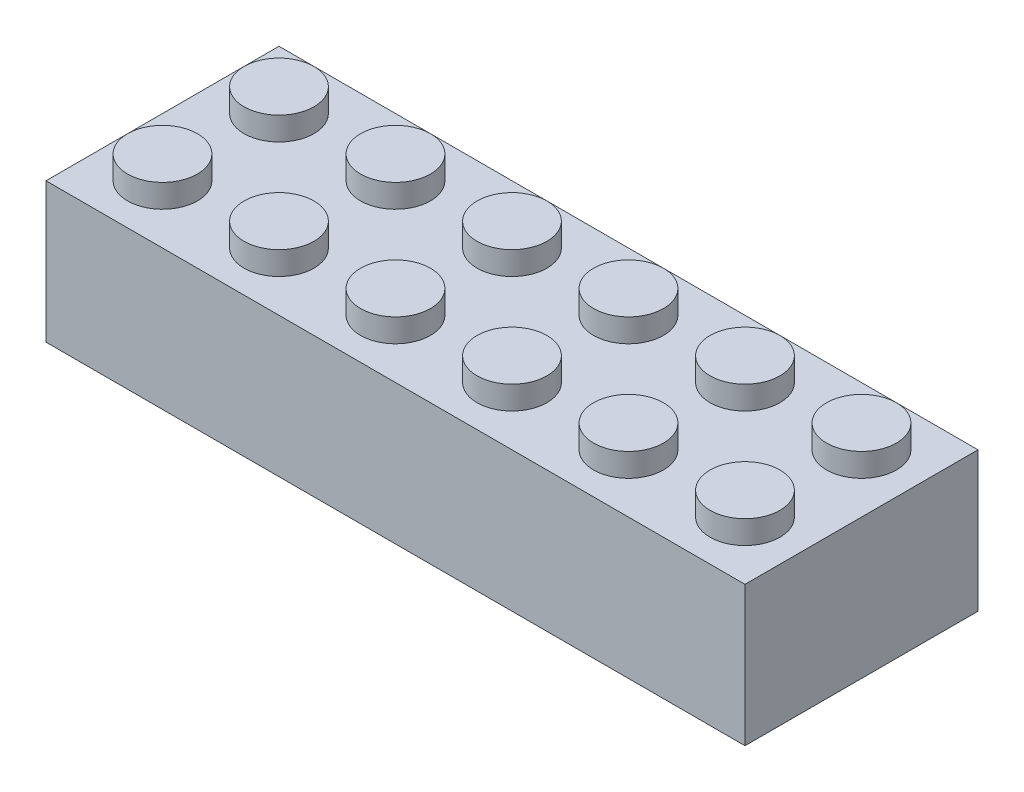
ISO-10303-21;
HEADER;
FILE_DESCRIPTION(('STEP AP214'),'2;1');
FILE_NAME('part.step','',(''),(''),'','','');
FILE_SCHEMA(('AUTOMOTIVE_DESIGN { 1 0 10303 214 1 1 1 1 }'));
ENDSEC;
DATA;
#1=APPLICATION_CONTEXT('core data for automotive mechanical design processes');
#2=APPLICATION_PROTOCOL_DEFINITION('international standard','automotive_design',2000,#1);
#3=PRODUCT_CONTEXT('',#1,'mechanical');
#4=PRODUCT('Part','Part','',(#3));
#5=PRODUCT_RELATED_PRODUCT_CATEGORY('part','',(#4));
#6=PRODUCT_DEFINITION_FORMATION('','',#4);
#7=PRODUCT_DEFINITION_CONTEXT('part definition',#1,'design');
#8=PRODUCT_DEFINITION('design','',#6,#7);
#9=PRODUCT_DEFINITION_SHAPE('','',#8);
#10=(LENGTH_UNIT() NAMED_UNIT(*) SI_UNIT(.MILLI.,.METRE.));
#11=(NAMED_UNIT(*) PLANE_ANGLE_UNIT() SI_UNIT($,.RADIAN.));
#12=(NAMED_UNIT(*) SI_UNIT($,.STERADIAN.) SOLID_ANGLE_UNIT());
#13=UNCERTAINTY_MEASURE_WITH_UNIT(LENGTH_MEASURE(1.E-05),#10,'distance_accuracy_value','');
#14=(GEOMETRIC_REPRESENTATION_CONTEXT(3) GLOBAL_UNCERTAINTY_ASSIGNED_CONTEXT((#13)) GLOBAL_UNIT_ASSIGNED_CONTEXT((#10,
#11,#12)) REPRESENTATION_CONTEXT('',''));
#15=CARTESIAN_POINT('',(0.,0.,0.));
#16=DIRECTION('',(0.,0.,1.));
#17=DIRECTION('',(1.,0.,0.));
#18=AXIS2_PLACEMENT_3D('',#15,#16,#17);
#19=CARTESIAN_POINT('',(-2.5,2.,-2.5));
#20=DIRECTION('',(0.,-1.,0.));
#21=DIRECTION('',(0.,0.,-1.));
#22=AXIS2_PLACEMENT_3D('',#19,#20,#21);
#23=CYLINDRICAL_SURFACE('',#22,1.5);
#24=CARTESIAN_POINT('',(-2.5,1.,-2.5));
#25=DIRECTION('',(0.,1.,0.));
#26=DIRECTION('',(0.,0.,1.));
#27=AXIS2_PLACEMENT_3D('',#24,#25,#26);
#28=CIRCLE('',#27,1.5);
#29=CARTESIAN_POINT('',(-2.5,1.,-1.));
#30=VERTEX_POINT('',#29);
#31=EDGE_CURVE('E185',#30,#30,#28,.T.);
#32=ORIENTED_EDGE('',*,*,#31,.T.);
#33=EDGE_LOOP('',(#32));
#34=FACE_BOUND('',#33,.T.);
#35=CARTESIAN_POINT('',(-2.5,2.,-2.5));
#36=DIRECTION('',(0.,1.,0.));
#37=DIRECTION('',(0.,0.,1.));
#38=AXIS2_PLACEMENT_3D('',#35,#36,#37);
#39=CIRCLE('',#38,1.5);
#40=CARTESIAN_POINT('',(-2.5,2.,-1.));
#41=VERTEX_POINT('',#40);
#42=EDGE_CURVE('E315',#41,#41,#39,.T.);
#43=ORIENTED_EDGE('',*,*,#42,.F.);
#44=EDGE_LOOP('',(#43));
#45=FACE_BOUND('',#44,.T.);
#46=ADVANCED_FACE('F110',(#34,#45),#23,.T.);
#47=CARTESIAN_POINT('',(0.,2.,0.));
#48=DIRECTION('',(0.,1.,0.));
#49=DIRECTION('',(0.,0.,1.));
#50=AXIS2_PLACEMENT_3D('',#47,#48,#49);
#51=PLANE('',#50);
#52=ORIENTED_EDGE('',*,*,#42,.T.);
#53=EDGE_LOOP('',(#52));
#54=FACE_BOUND('',#53,.T.);
#55=ADVANCED_FACE('F359',(#54),#51,.T.);
#56=CARTESIAN_POINT('',(-15.,1.,5.));
#57=DIRECTION('',(0.,0.,-1.));
#58=DIRECTION('',(-1.,0.,0.));
#59=AXIS2_PLACEMENT_3D('',#56,#57,#58);
#60=PLANE('',#59);
#61=DIRECTION('',(0.,-1.,0.));
#62=VECTOR('',#61,1.);
#63=CARTESIAN_POINT('',(-15.,1.,5.));
#64=LINE('',#63,#62);
#65=CARTESIAN_POINT('',(-15.,1.,5.));
#66=VERTEX_POINT('',#65);
#67=CARTESIAN_POINT('',(-15.,-5.,5.));
#68=VERTEX_POINT('',#67);
#69=EDGE_CURVE('E132',#66,#68,#64,.T.);
#70=ORIENTED_EDGE('',*,*,#69,.T.);
#71=DIRECTION('',(1.,0.,0.));
#72=VECTOR('',#71,1.);
#73=CARTESIAN_POINT('',(0.,-5.,5.));
#74=LINE('',#73,#72);
#75=CARTESIAN_POINT('',(15.,-5.,5.));
#76=VERTEX_POINT('',#75);
#77=EDGE_CURVE('E194',#68,#76,#74,.T.);
#78=ORIENTED_EDGE('',*,*,#77,.T.);
#79=DIRECTION('',(0.,-1.,0.));
#80=VECTOR('',#79,1.);
#81=CARTESIAN_POINT('',(15.,1.,5.));
#82=LINE('',#81,#80);
#83=CARTESIAN_POINT('',(15.,1.,5.));
#84=VERTEX_POINT('',#83);
#85=EDGE_CURVE('E176',#84,#76,#82,.T.);
#86=ORIENTED_EDGE('',*,*,#85,.F.);
#87=DIRECTION('',(1.,0.,0.));
#88=VECTOR('',#87,1.);
#89=CARTESIAN_POINT('',(-15.,1.,5.));
#90=LINE('',#89,#88);
#91=EDGE_CURVE('E303',#66,#84,#90,.T.);
#92=ORIENTED_EDGE('',*,*,#91,.F.);
#93=EDGE_LOOP('',(#70,#78,#86,#92));
#94=FACE_BOUND('',#93,.T.);
#95=ADVANCED_FACE('F198',(#94),#60,.F.);
#96=CARTESIAN_POINT('',(15.,1.,5.));
#97=DIRECTION('',(-1.,0.,0.));
#98=DIRECTION('',(0.,0.,1.));
#99=AXIS2_PLACEMENT_3D('',#96,#97,#98);
#100=PLANE('',#99);
#101=ORIENTED_EDGE('',*,*,#85,.T.);
#102=DIRECTION('',(0.,0.,-1.));
#103=VECTOR('',#102,1.);
#104=CARTESIAN_POINT('',(15.,-5.,0.));
#105=LINE('',#104,#103);
#106=CARTESIAN_POINT('',(15.,-5.,-5.));
#107=VERTEX_POINT('',#106);
#108=EDGE_CURVE('E180',#76,#107,#105,.T.);
#109=ORIENTED_EDGE('',*,*,#108,.T.);
#110=DIRECTION('',(0.,-1.,0.));
#111=VECTOR('',#110,1.);
#112=CARTESIAN_POINT('',(15.,1.,-5.));
#113=LINE('',#112,#111);
#114=CARTESIAN_POINT('',(15.,1.,-5.));
#115=VERTEX_POINT('',#114);
#116=EDGE_CURVE('E186',#115,#107,#113,.T.);
#117=ORIENTED_EDGE('',*,*,#116,.F.);
#118=DIRECTION('',(0.,0.,-1.));
#119=VECTOR('',#118,1.);
#120=CARTESIAN_POINT('',(15.,1.,5.));
#121=LINE('',#120,#119);
#122=EDGE_CURVE('E181',#84,#115,#121,.T.);
#123=ORIENTED_EDGE('',*,*,#122,.F.);
#124=EDGE_LOOP('',(#101,#109,#117,#123));
#125=FACE_BOUND('',#124,.T.);
#126=ADVANCED_FACE('F178',(#125),#100,.F.);
#127=CARTESIAN_POINT('',(-15.,1.,-5.));
#128=DIRECTION('',(0.,0.,-1.));
#129=DIRECTION('',(-1.,0.,0.));
#130=AXIS2_PLACEMENT_3D('',#127,#128,#129);
#131=PLANE('',#130);
#132=ORIENTED_EDGE('',*,*,#116,.T.);
#133=DIRECTION('',(1.,0.,0.));
#134=VECTOR('',#133,1.);
#135=CARTESIAN_POINT('',(0.,-5.,-5.));
#136=LINE('',#135,#134);
#137=CARTESIAN_POINT('',(-15.,-5.,-5.));
#138=VERTEX_POINT('',#137);
#139=EDGE_CURVE('E196',#138,#107,#136,.T.);
#140=ORIENTED_EDGE('',*,*,#139,.F.);
#141=DIRECTION('',(0.,-1.,0.));
#142=VECTOR('',#141,1.);
#143=CARTESIAN_POINT('',(-15.,1.,-5.));
#144=LINE('',#143,#142);
#145=CARTESIAN_POINT('',(-15.,1.,-5.));
#146=VERTEX_POINT('',#145);
#147=EDGE_CURVE('E312',#146,#138,#144,.T.);
#148=ORIENTED_EDGE('',*,*,#147,.F.);
#149=DIRECTION('',(1.,0.,0.));
#150=VECTOR('',#149,1.);
#151=CARTESIAN_POINT('',(-15.,1.,-5.));
#152=LINE('',#151,#150);
#153=EDGE_CURVE('E306',#146,#115,#152,.T.);
#154=ORIENTED_EDGE('',*,*,#153,.T.);
#155=EDGE_LOOP('',(#132,#140,#148,#154));
#156=FACE_BOUND('',#155,.T.);
#157=ADVANCED_FACE('F379',(#156),#131,.T.);
#158=CARTESIAN_POINT('',(-15.,1.,5.));
#159=DIRECTION('',(-1.,0.,0.));
#160=DIRECTION('',(0.,0.,1.));
#161=AXIS2_PLACEMENT_3D('',#158,#159,#160);
#162=PLANE('',#161);
#163=ORIENTED_EDGE('',*,*,#147,.T.);
#164=DIRECTION('',(0.,0.,-1.));
#165=VECTOR('',#164,1.);
#166=CARTESIAN_POINT('',(-15.,-5.,0.));
#167=LINE('',#166,#165);
#168=EDGE_CURVE('E208',#68,#138,#167,.T.);
#169=ORIENTED_EDGE('',*,*,#168,.F.);
#170=ORIENTED_EDGE('',*,*,#69,.F.);
#171=DIRECTION('',(0.,0.,-1.));
#172=VECTOR('',#171,1.);
#173=CARTESIAN_POINT('',(-15.,1.,5.));
#174=LINE('',#173,#172);
#175=EDGE_CURVE('E309',#66,#146,#174,.T.);
#176=ORIENTED_EDGE('',*,*,#175,.T.);
#177=EDGE_LOOP('',(#163,#169,#170,#176));
#178=FACE_BOUND('',#177,.T.);
#179=ADVANCED_FACE('F373',(#178),#162,.T.);
#180=CARTESIAN_POINT('',(0.,1.,0.));
#181=DIRECTION('',(0.,1.,0.));
#182=DIRECTION('',(0.,0.,1.));
#183=AXIS2_PLACEMENT_3D('',#180,#181,#182);
#184=PLANE('',#183);
#185=CARTESIAN_POINT('',(2.50000000000005,1.,2.5));
#186=DIRECTION('',(0.,1.,0.));
#187=DIRECTION('',(0.,0.,1.));
#188=AXIS2_PLACEMENT_3D('',#185,#186,#187);
#189=CIRCLE('',#188,1.5);
#190=CARTESIAN_POINT('',(2.50000000000005,1.,4.));
#191=VERTEX_POINT('',#190);
#192=EDGE_CURVE('E240',#191,#191,#189,.F.);
#193=ORIENTED_EDGE('',*,*,#192,.T.);
#194=EDGE_LOOP('',(#193));
#195=FACE_BOUND('',#194,.T.);
#196=CARTESIAN_POINT('',(7.50000000000005,1.,2.5));
#197=DIRECTION('',(0.,1.,0.));
#198=DIRECTION('',(0.,0.,1.));
#199=AXIS2_PLACEMENT_3D('',#196,#197,#198);
#200=CIRCLE('',#199,1.5);
#201=CARTESIAN_POINT('',(7.50000000000005,1.,4.));
#202=VERTEX_POINT('',#201);
#203=EDGE_CURVE('E246',#202,#202,#200,.F.);
#204=ORIENTED_EDGE('',*,*,#203,.T.);
#205=EDGE_LOOP('',(#204));
#206=FACE_BOUND('',#205,.T.);
#207=CARTESIAN_POINT('',(12.5000000000001,1.,2.5));
#208=DIRECTION('',(0.,1.,0.));
#209=DIRECTION('',(0.,0.,1.));
#210=AXIS2_PLACEMENT_3D('',#207,#208,#209);
#211=CIRCLE('',#210,1.5);
#212=CARTESIAN_POINT('',(12.5000000000001,1.,4.));
#213=VERTEX_POINT('',#212);
#214=EDGE_CURVE('E252',#213,#213,#211,.F.);
#215=ORIENTED_EDGE('',*,*,#214,.T.);
#216=EDGE_LOOP('',(#215));
#217=FACE_BOUND('',#216,.T.);
#218=CARTESIAN_POINT('',(12.5,1.,-2.5));
#219=DIRECTION('',(0.,1.,0.));
#220=DIRECTION('',(0.,0.,1.));
#221=AXIS2_PLACEMENT_3D('',#218,#219,#220);
#222=CIRCLE('',#221,1.5);
#223=CARTESIAN_POINT('',(12.5,1.,-1.));
#224=VERTEX_POINT('',#223);
#225=EDGE_CURVE('E258',#224,#224,#222,.F.);
#226=ORIENTED_EDGE('',*,*,#225,.T.);
#227=EDGE_LOOP('',(#226));
#228=FACE_BOUND('',#227,.T.);
#229=CARTESIAN_POINT('',(7.5,1.,-2.5));
#230=DIRECTION('',(0.,1.,0.));
#231=DIRECTION('',(0.,0.,1.));
#232=AXIS2_PLACEMENT_3D('',#229,#230,#231);
#233=CIRCLE('',#232,1.5);
#234=CARTESIAN_POINT('',(7.5,1.,-1.));
#235=VERTEX_POINT('',#234);
#236=EDGE_CURVE('E264',#235,#235,#233,.F.);
#237=ORIENTED_EDGE('',*,*,#236,.T.);
#238=EDGE_LOOP('',(#237));
#239=FACE_BOUND('',#238,.T.);
#240=CARTESIAN_POINT('',(2.5,1.,-2.5));
#241=DIRECTION('',(0.,1.,0.));
#242=DIRECTION('',(0.,0.,1.));
#243=AXIS2_PLACEMENT_3D('',#240,#241,#242);
#244=CIRCLE('',#243,1.5);
#245=CARTESIAN_POINT('',(2.5,1.,-1.));
#246=VERTEX_POINT('',#245);
#247=EDGE_CURVE('E270',#246,#246,#244,.F.);
#248=ORIENTED_EDGE('',*,*,#247,.T.);
#249=EDGE_LOOP('',(#248));
#250=FACE_BOUND('',#249,.T.);
#251=CARTESIAN_POINT('',(-2.49999999999995,1.,2.5));
#252=DIRECTION('',(0.,1.,0.));
#253=DIRECTION('',(0.,0.,1.));
#254=AXIS2_PLACEMENT_3D('',#251,#252,#253);
#255=CIRCLE('',#254,1.5);
#256=CARTESIAN_POINT('',(-2.49999999999995,1.,4.));
#257=VERTEX_POINT('',#256);
#258=EDGE_CURVE('E276',#257,#257,#255,.F.);
#259=ORIENTED_EDGE('',*,*,#258,.T.);
#260=EDGE_LOOP('',(#259));
#261=FACE_BOUND('',#260,.T.);
#262=CARTESIAN_POINT('',(-7.49999999999995,1.,2.5));
#263=DIRECTION('',(0.,1.,0.));
#264=DIRECTION('',(0.,0.,1.));
#265=AXIS2_PLACEMENT_3D('',#262,#263,#264);
#266=CIRCLE('',#265,1.5);
#267=CARTESIAN_POINT('',(-7.49999999999995,1.,4.));
#268=VERTEX_POINT('',#267);
#269=EDGE_CURVE('E282',#268,#268,#266,.F.);
#270=ORIENTED_EDGE('',*,*,#269,.T.);
#271=EDGE_LOOP('',(#270));
#272=FACE_BOUND('',#271,.T.);
#273=CARTESIAN_POINT('',(-12.4999999999999,1.,2.5));
#274=DIRECTION('',(0.,1.,0.));
#275=DIRECTION('',(0.,0.,1.));
#276=AXIS2_PLACEMENT_3D('',#273,#274,#275);
#277=CIRCLE('',#276,1.5);
#278=CARTESIAN_POINT('',(-12.4999999999999,1.,4.));
#279=VERTEX_POINT('',#278);
#280=EDGE_CURVE('E288',#279,#279,#277,.F.);
#281=ORIENTED_EDGE('',*,*,#280,.T.);
#282=EDGE_LOOP('',(#281));
#283=FACE_BOUND('',#282,.T.);
#284=CARTESIAN_POINT('',(-12.5,1.,-2.5));
#285=DIRECTION('',(0.,1.,0.));
#286=DIRECTION('',(0.,0.,1.));
#287=AXIS2_PLACEMENT_3D('',#284,#285,#286);
#288=CIRCLE('',#287,1.5);
#289=CARTESIAN_POINT('',(-12.5,1.,-1.));
#290=VERTEX_POINT('',#289);
#291=EDGE_CURVE('E294',#290,#290,#288,.F.);
#292=ORIENTED_EDGE('',*,*,#291,.T.);
#293=EDGE_LOOP('',(#292));
#294=FACE_BOUND('',#293,.T.);
#295=CARTESIAN_POINT('',(-7.5,1.,-2.5));
#296=DIRECTION('',(0.,1.,0.));
#297=DIRECTION('',(0.,0.,1.));
#298=AXIS2_PLACEMENT_3D('',#295,#296,#297);
#299=CIRCLE('',#298,1.5);
#300=CARTESIAN_POINT('',(-7.5,1.,-1.));
#301=VERTEX_POINT('',#300);
#302=EDGE_CURVE('E300',#301,#301,#299,.F.);
#303=ORIENTED_EDGE('',*,*,#302,.T.);
#304=EDGE_LOOP('',(#303));
#305=FACE_BOUND('',#304,.T.);
#306=ORIENTED_EDGE('',*,*,#31,.F.);
#307=EDGE_LOOP('',(#306));
#308=FACE_BOUND('',#307,.T.);
#309=ORIENTED_EDGE('',*,*,#91,.T.);
#310=ORIENTED_EDGE('',*,*,#122,.T.);
#311=ORIENTED_EDGE('',*,*,#153,.F.);
#312=ORIENTED_EDGE('',*,*,#175,.F.);
#313=EDGE_LOOP('',(#309,#310,#311,#312));
#314=FACE_BOUND('',#313,.T.);
#315=ADVANCED_FACE('F369',(#195,#206,#217,#228,#239,#250,#261,#272,#283,#294,#305,#308,#314),
#184,.T.);
#316=CARTESIAN_POINT('',(-7.5,2.,-2.5));
#317=DIRECTION('',(0.,-1.,0.));
#318=DIRECTION('',(0.,0.,-1.));
#319=AXIS2_PLACEMENT_3D('',#316,#317,#318);
#320=CYLINDRICAL_SURFACE('',#319,1.5);
#321=ORIENTED_EDGE('',*,*,#302,.F.);
#322=EDGE_LOOP('',(#321));
#323=FACE_BOUND('',#322,.T.);
#324=CARTESIAN_POINT('',(-7.5,2.,-2.5));
#325=DIRECTION('',(0.,1.,0.));
#326=DIRECTION('',(0.,0.,1.));
#327=AXIS2_PLACEMENT_3D('',#324,#325,#326);
#328=CIRCLE('',#327,1.5);
#329=CARTESIAN_POINT('',(-7.5,2.,-1.));
#330=VERTEX_POINT('',#329);
#331=EDGE_CURVE('E297',#330,#330,#328,.T.);
#332=ORIENTED_EDGE('',*,*,#331,.F.);
#333=EDGE_LOOP('',(#332));
#334=FACE_BOUND('',#333,.T.);
#335=ADVANCED_FACE('F372',(#323,#334),#320,.T.);
#336=CARTESIAN_POINT('',(0.,2.,0.));
#337=DIRECTION('',(0.,1.,0.));
#338=DIRECTION('',(0.,0.,1.));
#339=AXIS2_PLACEMENT_3D('',#336,#337,#338);
#340=PLANE('',#339);
#341=ORIENTED_EDGE('',*,*,#331,.T.);
#342=EDGE_LOOP('',(#341));
#343=FACE_BOUND('',#342,.T.);
#344=ADVANCED_FACE('F679',(#343),#340,.T.);
#345=CARTESIAN_POINT('',(-12.5,2.,-2.5));
#346=DIRECTION('',(0.,-1.,0.));
#347=DIRECTION('',(0.,0.,-1.));
#348=AXIS2_PLACEMENT_3D('',#345,#346,#347);
#349=CYLINDRICAL_SURFACE('',#348,1.5);
#350=ORIENTED_EDGE('',*,*,#291,.F.);
#351=EDGE_LOOP('',(#350));
#352=FACE_BOUND('',#351,.T.);
#353=CARTESIAN_POINT('',(-12.5,2.,-2.5));
#354=DIRECTION('',(0.,1.,0.));
#355=DIRECTION('',(0.,0.,1.));
#356=AXIS2_PLACEMENT_3D('',#353,#354,#355);
#357=CIRCLE('',#356,1.5);
#358=CARTESIAN_POINT('',(-12.5,2.,-1.));
#359=VERTEX_POINT('',#358);
#360=EDGE_CURVE('E291',#359,#359,#357,.T.);
#361=ORIENTED_EDGE('',*,*,#360,.F.);
#362=EDGE_LOOP('',(#361));
#363=FACE_BOUND('',#362,.T.);
#364=ADVANCED_FACE('F689',(#352,#363),#349,.T.);
#365=CARTESIAN_POINT('',(0.,2.,0.));
#366=DIRECTION('',(0.,1.,0.));
#367=DIRECTION('',(0.,0.,1.));
#368=AXIS2_PLACEMENT_3D('',#365,#366,#367);
#369=PLANE('',#368);
#370=ORIENTED_EDGE('',*,*,#360,.T.);
#371=EDGE_LOOP('',(#370));
#372=FACE_BOUND('',#371,.T.);
#373=ADVANCED_FACE('F699',(#372),#369,.T.);
#374=CARTESIAN_POINT('',(-12.4999999999999,2.,2.5));
#375=DIRECTION('',(0.,-1.,0.));
#376=DIRECTION('',(0.,0.,-1.));
#377=AXIS2_PLACEMENT_3D('',#374,#375,#376);
#378=CYLINDRICAL_SURFACE('',#377,1.5);
#379=ORIENTED_EDGE('',*,*,#280,.F.);
#380=EDGE_LOOP('',(#379));
#381=FACE_BOUND('',#380,.T.);
#382=CARTESIAN_POINT('',(-12.4999999999999,2.,2.5));
#383=DIRECTION('',(0.,1.,0.));
#384=DIRECTION('',(0.,0.,1.));
#385=AXIS2_PLACEMENT_3D('',#382,#383,#384);
#386=CIRCLE('',#385,1.5);
#387=CARTESIAN_POINT('',(-12.4999999999999,2.,4.));
#388=VERTEX_POINT('',#387);
#389=EDGE_CURVE('E285',#388,#388,#386,.T.);
#390=ORIENTED_EDGE('',*,*,#389,.F.);
#391=EDGE_LOOP('',(#390));
#392=FACE_BOUND('',#391,.T.);
#393=ADVANCED_FACE('F709',(#381,#392),#378,.T.);
#394=CARTESIAN_POINT('',(0.,2.,0.));
#395=DIRECTION('',(0.,1.,0.));
#396=DIRECTION('',(0.,0.,1.));
#397=AXIS2_PLACEMENT_3D('',#394,#395,#396);
#398=PLANE('',#397);
#399=ORIENTED_EDGE('',*,*,#389,.T.);
#400=EDGE_LOOP('',(#399));
#401=FACE_BOUND('',#400,.T.);
#402=ADVANCED_FACE('F719',(#401),#398,.T.);
#403=CARTESIAN_POINT('',(-7.49999999999995,2.,2.5));
#404=DIRECTION('',(0.,-1.,0.));
#405=DIRECTION('',(0.,0.,-1.));
#406=AXIS2_PLACEMENT_3D('',#403,#404,#405);
#407=CYLINDRICAL_SURFACE('',#406,1.5);
#408=ORIENTED_EDGE('',*,*,#269,.F.);
#409=EDGE_LOOP('',(#408));
#410=FACE_BOUND('',#409,.T.);
#411=CARTESIAN_POINT('',(-7.49999999999995,2.,2.5));
#412=DIRECTION('',(0.,1.,0.));
#413=DIRECTION('',(0.,0.,1.));
#414=AXIS2_PLACEMENT_3D('',#411,#412,#413);
#415=CIRCLE('',#414,1.5);
#416=CARTESIAN_POINT('',(-7.49999999999995,2.,4.));
#417=VERTEX_POINT('',#416);
#418=EDGE_CURVE('E279',#417,#417,#415,.T.);
#419=ORIENTED_EDGE('',*,*,#418,.F.);
#420=EDGE_LOOP('',(#419));
#421=FACE_BOUND('',#420,.T.);
#422=ADVANCED_FACE('F729',(#410,#421),#407,.T.);
#423=CARTESIAN_POINT('',(0.,2.,0.));
#424=DIRECTION('',(0.,1.,0.));
#425=DIRECTION('',(0.,0.,1.));
#426=AXIS2_PLACEMENT_3D('',#423,#424,#425);
#427=PLANE('',#426);
#428=ORIENTED_EDGE('',*,*,#418,.T.);
#429=EDGE_LOOP('',(#428));
#430=FACE_BOUND('',#429,.T.);
#431=ADVANCED_FACE('F739',(#430),#427,.T.);
#432=CARTESIAN_POINT('',(-2.49999999999995,2.,2.5));
#433=DIRECTION('',(0.,-1.,0.));
#434=DIRECTION('',(0.,0.,-1.));
#435=AXIS2_PLACEMENT_3D('',#432,#433,#434);
#436=CYLINDRICAL_SURFACE('',#435,1.5);
#437=ORIENTED_EDGE('',*,*,#258,.F.);
#438=EDGE_LOOP('',(#437));
#439=FACE_BOUND('',#438,.T.);
#440=CARTESIAN_POINT('',(-2.49999999999995,2.,2.5));
#441=DIRECTION('',(0.,1.,0.));
#442=DIRECTION('',(0.,0.,1.));
#443=AXIS2_PLACEMENT_3D('',#440,#441,#442);
#444=CIRCLE('',#443,1.5);
#445=CARTESIAN_POINT('',(-2.49999999999995,2.,4.));
#446=VERTEX_POINT('',#445);
#447=EDGE_CURVE('E273',#446,#446,#444,.T.);
#448=ORIENTED_EDGE('',*,*,#447,.F.);
#449=EDGE_LOOP('',(#448));
#450=FACE_BOUND('',#449,.T.);
#451=ADVANCED_FACE('F749',(#439,#450),#436,.T.);
#452=CARTESIAN_POINT('',(0.,2.,0.));
#453=DIRECTION('',(0.,1.,0.));
#454=DIRECTION('',(0.,0.,1.));
#455=AXIS2_PLACEMENT_3D('',#452,#453,#454);
#456=PLANE('',#455);
#457=ORIENTED_EDGE('',*,*,#447,.T.);
#458=EDGE_LOOP('',(#457));
#459=FACE_BOUND('',#458,.T.);
#460=ADVANCED_FACE('F759',(#459),#456,.T.);
#461=CARTESIAN_POINT('',(2.5,2.,-2.5));
#462=DIRECTION('',(0.,-1.,0.));
#463=DIRECTION('',(0.,0.,-1.));
#464=AXIS2_PLACEMENT_3D('',#461,#462,#463);
#465=CYLINDRICAL_SURFACE('',#464,1.5);
#466=ORIENTED_EDGE('',*,*,#247,.F.);
#467=EDGE_LOOP('',(#466));
#468=FACE_BOUND('',#467,.T.);
#469=CARTESIAN_POINT('',(2.5,2.,-2.5));
#470=DIRECTION('',(0.,1.,0.));
#471=DIRECTION('',(0.,0.,1.));
#472=AXIS2_PLACEMENT_3D('',#469,#470,#471);
#473=CIRCLE('',#472,1.5);
#474=CARTESIAN_POINT('',(2.5,2.,-1.));
#475=VERTEX_POINT('',#474);
#476=EDGE_CURVE('E267',#475,#475,#473,.T.);
#477=ORIENTED_EDGE('',*,*,#476,.F.);
#478=EDGE_LOOP('',(#477));
#479=FACE_BOUND('',#478,.T.);
#480=ADVANCED_FACE('F769',(#468,#479),#465,.T.);
#481=CARTESIAN_POINT('',(0.,2.,0.));
#482=DIRECTION('',(0.,1.,0.));
#483=DIRECTION('',(0.,0.,1.));
#484=AXIS2_PLACEMENT_3D('',#481,#482,#483);
#485=PLANE('',#484);
#486=ORIENTED_EDGE('',*,*,#476,.T.);
#487=EDGE_LOOP('',(#486));
#488=FACE_BOUND('',#487,.T.);
#489=ADVANCED_FACE('F779',(#488),#485,.T.);
#490=CARTESIAN_POINT('',(7.5,2.,-2.5));
#491=DIRECTION('',(0.,-1.,0.));
#492=DIRECTION('',(0.,0.,-1.));
#493=AXIS2_PLACEMENT_3D('',#490,#491,#492);
#494=CYLINDRICAL_SURFACE('',#493,1.5);
#495=ORIENTED_EDGE('',*,*,#236,.F.);
#496=EDGE_LOOP('',(#495));
#497=FACE_BOUND('',#496,.T.);
#498=CARTESIAN_POINT('',(7.5,2.,-2.5));
#499=DIRECTION('',(0.,1.,0.));
#500=DIRECTION('',(0.,0.,1.));
#501=AXIS2_PLACEMENT_3D('',#498,#499,#500);
#502=CIRCLE('',#501,1.5);
#503=CARTESIAN_POINT('',(7.5,2.,-1.));
#504=VERTEX_POINT('',#503);
#505=EDGE_CURVE('E261',#504,#504,#502,.T.);
#506=ORIENTED_EDGE('',*,*,#505,.F.);
#507=EDGE_LOOP('',(#506));
#508=FACE_BOUND('',#507,.T.);
#509=ADVANCED_FACE('F789',(#497,#508),#494,.T.);
#510=CARTESIAN_POINT('',(0.,2.,0.));
#511=DIRECTION('',(0.,1.,0.));
#512=DIRECTION('',(0.,0.,1.));
#513=AXIS2_PLACEMENT_3D('',#510,#511,#512);
#514=PLANE('',#513);
#515=ORIENTED_EDGE('',*,*,#505,.T.);
#516=EDGE_LOOP('',(#515));
#517=FACE_BOUND('',#516,.T.);
#518=ADVANCED_FACE('F799',(#517),#514,.T.);
#519=CARTESIAN_POINT('',(12.5,2.,-2.5));
#520=DIRECTION('',(0.,-1.,0.));
#521=DIRECTION('',(0.,0.,-1.));
#522=AXIS2_PLACEMENT_3D('',#519,#520,#521);
#523=CYLINDRICAL_SURFACE('',#522,1.5);
#524=ORIENTED_EDGE('',*,*,#225,.F.);
#525=EDGE_LOOP('',(#524));
#526=FACE_BOUND('',#525,.T.);
#527=CARTESIAN_POINT('',(12.5,2.,-2.5));
#528=DIRECTION('',(0.,1.,0.));
#529=DIRECTION('',(0.,0.,1.));
#530=AXIS2_PLACEMENT_3D('',#527,#528,#529);
#531=CIRCLE('',#530,1.5);
#532=CARTESIAN_POINT('',(12.5,2.,-1.));
#533=VERTEX_POINT('',#532);
#534=EDGE_CURVE('E255',#533,#533,#531,.T.);
#535=ORIENTED_EDGE('',*,*,#534,.F.);
#536=EDGE_LOOP('',(#535));
#537=FACE_BOUND('',#536,.T.);
#538=ADVANCED_FACE('F809',(#526,#537),#523,.T.);
#539=CARTESIAN_POINT('',(0.,2.,0.));
#540=DIRECTION('',(0.,1.,0.));
#541=DIRECTION('',(0.,0.,1.));
#542=AXIS2_PLACEMENT_3D('',#539,#540,#541);
#543=PLANE('',#542);
#544=ORIENTED_EDGE('',*,*,#534,.T.);
#545=EDGE_LOOP('',(#544));
#546=FACE_BOUND('',#545,.T.);
#547=ADVANCED_FACE('F819',(#546),#543,.T.);
#548=CARTESIAN_POINT('',(12.5000000000001,2.,2.5));
#549=DIRECTION('',(0.,-1.,0.));
#550=DIRECTION('',(0.,0.,-1.));
#551=AXIS2_PLACEMENT_3D('',#548,#549,#550);
#552=CYLINDRICAL_SURFACE('',#551,1.5);
#553=ORIENTED_EDGE('',*,*,#214,.F.);
#554=EDGE_LOOP('',(#553));
#555=FACE_BOUND('',#554,.T.);
#556=CARTESIAN_POINT('',(12.5000000000001,2.,2.5));
#557=DIRECTION('',(0.,1.,0.));
#558=DIRECTION('',(0.,0.,1.));
#559=AXIS2_PLACEMENT_3D('',#556,#557,#558);
#560=CIRCLE('',#559,1.5);
#561=CARTESIAN_POINT('',(12.5000000000001,2.,4.));
#562=VERTEX_POINT('',#561);
#563=EDGE_CURVE('E249',#562,#562,#560,.T.);
#564=ORIENTED_EDGE('',*,*,#563,.F.);
#565=EDGE_LOOP('',(#564));
#566=FACE_BOUND('',#565,.T.);
#567=ADVANCED_FACE('F829',(#555,#566),#552,.T.);
#568=CARTESIAN_POINT('',(0.,2.,0.));
#569=DIRECTION('',(0.,1.,0.));
#570=DIRECTION('',(0.,0.,1.));
#571=AXIS2_PLACEMENT_3D('',#568,#569,#570);
#572=PLANE('',#571);
#573=ORIENTED_EDGE('',*,*,#563,.T.);
#574=EDGE_LOOP('',(#573));
#575=FACE_BOUND('',#574,.T.);
#576=ADVANCED_FACE('F839',(#575),#572,.T.);
#577=CARTESIAN_POINT('',(7.50000000000005,2.,2.5));
#578=DIRECTION('',(0.,-1.,0.));
#579=DIRECTION('',(0.,0.,-1.));
#580=AXIS2_PLACEMENT_3D('',#577,#578,#579);
#581=CYLINDRICAL_SURFACE('',#580,1.5);
#582=ORIENTED_EDGE('',*,*,#203,.F.);
#583=EDGE_LOOP('',(#582));
#584=FACE_BOUND('',#583,.T.);
#585=CARTESIAN_POINT('',(7.50000000000005,2.,2.5));
#586=DIRECTION('',(0.,1.,0.));
#587=DIRECTION('',(0.,0.,1.));
#588=AXIS2_PLACEMENT_3D('',#585,#586,#587);
#589=CIRCLE('',#588,1.5);
#590=CARTESIAN_POINT('',(7.50000000000005,2.,4.));
#591=VERTEX_POINT('',#590);
#592=EDGE_CURVE('E243',#591,#591,#589,.T.);
#593=ORIENTED_EDGE('',*,*,#592,.F.);
#594=EDGE_LOOP('',(#593));
#595=FACE_BOUND('',#594,.T.);
#596=ADVANCED_FACE('F849',(#584,#595),#581,.T.);
#597=CARTESIAN_POINT('',(0.,2.,0.));
#598=DIRECTION('',(0.,1.,0.));
#599=DIRECTION('',(0.,0.,1.));
#600=AXIS2_PLACEMENT_3D('',#597,#598,#599);
#601=PLANE('',#600);
#602=ORIENTED_EDGE('',*,*,#592,.T.);
#603=EDGE_LOOP('',(#602));
#604=FACE_BOUND('',#603,.T.);
#605=ADVANCED_FACE('F859',(#604),#601,.T.);
#606=CARTESIAN_POINT('',(2.50000000000005,2.,2.5));
#607=DIRECTION('',(0.,-1.,0.));
#608=DIRECTION('',(0.,0.,-1.));
#609=AXIS2_PLACEMENT_3D('',#606,#607,#608);
#610=CYLINDRICAL_SURFACE('',#609,1.5);
#611=ORIENTED_EDGE('',*,*,#192,.F.);
#612=EDGE_LOOP('',(#611));
#613=FACE_BOUND('',#612,.T.);
#614=CARTESIAN_POINT('',(2.50000000000005,2.,2.5));
#615=DIRECTION('',(0.,1.,0.));
#616=DIRECTION('',(0.,0.,1.));
#617=AXIS2_PLACEMENT_3D('',#614,#615,#616);
#618=CIRCLE('',#617,1.5);
#619=CARTESIAN_POINT('',(2.50000000000005,2.,4.));
#620=VERTEX_POINT('',#619);
#621=EDGE_CURVE('E232',#620,#620,#618,.T.);
#622=ORIENTED_EDGE('',*,*,#621,.F.);
#623=EDGE_LOOP('',(#622));
#624=FACE_BOUND('',#623,.T.);
#625=ADVANCED_FACE('F869',(#613,#624),#610,.T.);
#626=CARTESIAN_POINT('',(0.,2.,0.));
#627=DIRECTION('',(0.,1.,0.));
#628=DIRECTION('',(0.,0.,1.));
#629=AXIS2_PLACEMENT_3D('',#626,#627,#628);
#630=PLANE('',#629);
#631=ORIENTED_EDGE('',*,*,#621,.T.);
#632=EDGE_LOOP('',(#631));
#633=FACE_BOUND('',#632,.T.);
#634=ADVANCED_FACE('F423',(#633),#630,.T.);
#635=CARTESIAN_POINT('',(0.,-5.,-4.));
#636=DIRECTION('',(0.,0.,1.));
#637=DIRECTION('',(1.,0.,0.));
#638=AXIS2_PLACEMENT_3D('',#635,#636,#637);
#639=PLANE('',#638);
#640=DIRECTION('',(1.,0.,0.));
#641=VECTOR('',#640,1.);
#642=CARTESIAN_POINT('',(0.,0.,-4.));
#643=LINE('',#642,#641);
#644=CARTESIAN_POINT('',(-14.,0.,-4.));
#645=VERTEX_POINT('',#644);
#646=CARTESIAN_POINT('',(14.,0.,-4.));
#647=VERTEX_POINT('',#646);
#648=EDGE_CURVE('E222',#645,#647,#643,.T.);
#649=ORIENTED_EDGE('',*,*,#648,.F.);
#650=DIRECTION('',(0.,1.,0.));
#651=VECTOR('',#650,1.);
#652=CARTESIAN_POINT('',(-14.,-5.,-4.));
#653=LINE('',#652,#651);
#654=CARTESIAN_POINT('',(-14.,-5.,-4.));
#655=VERTEX_POINT('',#654);
#656=EDGE_CURVE('E230',#655,#645,#653,.T.);
#657=ORIENTED_EDGE('',*,*,#656,.F.);
#658=DIRECTION('',(1.,0.,0.));
#659=VECTOR('',#658,1.);
#660=CARTESIAN_POINT('',(0.,-5.,-4.));
#661=LINE('',#660,#659);
#662=CARTESIAN_POINT('',(14.,-5.,-4.));
#663=VERTEX_POINT('',#662);
#664=EDGE_CURVE('E210',#655,#663,#661,.T.);
#665=ORIENTED_EDGE('',*,*,#664,.T.);
#666=DIRECTION('',(0.,1.,0.));
#667=VECTOR('',#666,1.);
#668=CARTESIAN_POINT('',(14.,-5.,-4.));
#669=LINE('',#668,#667);
#670=EDGE_CURVE('E221',#663,#647,#669,.T.);
#671=ORIENTED_EDGE('',*,*,#670,.T.);
#672=EDGE_LOOP('',(#649,#657,#665,#671));
#673=FACE_BOUND('',#672,.T.);
#674=ADVANCED_FACE('F418',(#673),#639,.T.);
#675=CARTESIAN_POINT('',(-14.,-5.,0.));
#676=DIRECTION('',(-1.,0.,0.));
#677=DIRECTION('',(0.,0.,1.));
#678=AXIS2_PLACEMENT_3D('',#675,#676,#677);
#679=PLANE('',#678);
#680=DIRECTION('',(0.,0.,1.));
#681=VECTOR('',#680,1.);
#682=CARTESIAN_POINT('',(-14.,0.,0.));
#683=LINE('',#682,#681);
#684=CARTESIAN_POINT('',(-14.,0.,4.00000000000005));
#685=VERTEX_POINT('',#684);
#686=EDGE_CURVE('E199',#645,#685,#683,.T.);
#687=ORIENTED_EDGE('',*,*,#686,.T.);
#688=DIRECTION('',(0.,1.,0.));
#689=VECTOR('',#688,1.);
#690=CARTESIAN_POINT('',(-14.,-5.,4.00000000000005));
#691=LINE('',#690,#689);
#692=CARTESIAN_POINT('',(-14.,-5.,4.00000000000005));
#693=VERTEX_POINT('',#692);
#694=EDGE_CURVE('E233',#693,#685,#691,.T.);
#695=ORIENTED_EDGE('',*,*,#694,.F.);
#696=DIRECTION('',(0.,0.,1.));
#697=VECTOR('',#696,1.);
#698=CARTESIAN_POINT('',(-14.,-5.,0.));
#699=LINE('',#698,#697);
#700=EDGE_CURVE('E218',#655,#693,#699,.T.);
#701=ORIENTED_EDGE('',*,*,#700,.F.);
#702=ORIENTED_EDGE('',*,*,#656,.T.);
#703=EDGE_LOOP('',(#687,#695,#701,#702));
#704=FACE_BOUND('',#703,.T.);
#705=ADVANCED_FACE('F422',(#704),#679,.F.);
#706=CARTESIAN_POINT('',(0.,-5.,4.00000000000005));
#707=DIRECTION('',(0.,0.,1.));
#708=DIRECTION('',(1.,0.,0.));
#709=AXIS2_PLACEMENT_3D('',#706,#707,#708);
#710=PLANE('',#709);
#711=DIRECTION('',(1.,0.,0.));
#712=VECTOR('',#711,1.);
#713=CARTESIAN_POINT('',(0.,0.,4.00000000000005));
#714=LINE('',#713,#712);
#715=CARTESIAN_POINT('',(14.,0.,4.00000000000005));
#716=VERTEX_POINT('',#715);
#717=EDGE_CURVE('E124',#685,#716,#714,.T.);
#718=ORIENTED_EDGE('',*,*,#717,.T.);
#719=DIRECTION('',(0.,1.,0.));
#720=VECTOR('',#719,1.);
#721=CARTESIAN_POINT('',(14.,-5.,4.00000000000005));
#722=LINE('',#721,#720);
#723=CARTESIAN_POINT('',(14.,-5.,4.00000000000005));
#724=VERTEX_POINT('',#723);
#725=EDGE_CURVE('E235',#724,#716,#722,.T.);
#726=ORIENTED_EDGE('',*,*,#725,.F.);
#727=DIRECTION('',(1.,0.,0.));
#728=VECTOR('',#727,1.);
#729=CARTESIAN_POINT('',(0.,-5.,4.00000000000005));
#730=LINE('',#729,#728);
#731=EDGE_CURVE('E216',#693,#724,#730,.T.);
#732=ORIENTED_EDGE('',*,*,#731,.F.);
#733=ORIENTED_EDGE('',*,*,#694,.T.);
#734=EDGE_LOOP('',(#718,#726,#732,#733));
#735=FACE_BOUND('',#734,.T.);
#736=ADVANCED_FACE('F434',(#735),#710,.F.);
#737=CARTESIAN_POINT('',(14.,-5.,0.));
#738=DIRECTION('',(-1.,0.,0.));
#739=DIRECTION('',(0.,0.,1.));
#740=AXIS2_PLACEMENT_3D('',#737,#738,#739);
#741=PLANE('',#740);
#742=DIRECTION('',(0.,0.,1.));
#743=VECTOR('',#742,1.);
#744=CARTESIAN_POINT('',(14.,0.,0.));
#745=LINE('',#744,#743);
#746=EDGE_CURVE('E225',#647,#716,#745,.T.);
#747=ORIENTED_EDGE('',*,*,#746,.F.);
#748=ORIENTED_EDGE('',*,*,#670,.F.);
#749=DIRECTION('',(0.,0.,1.));
#750=VECTOR('',#749,1.);
#751=CARTESIAN_POINT('',(14.,-5.,0.));
#752=LINE('',#751,#750);
#753=EDGE_CURVE('E213',#663,#724,#752,.T.);
#754=ORIENTED_EDGE('',*,*,#753,.T.);
#755=ORIENTED_EDGE('',*,*,#725,.T.);
#756=EDGE_LOOP('',(#747,#748,#754,#755));
#757=FACE_BOUND('',#756,.T.);
#758=ADVANCED_FACE('F444',(#757),#741,.T.);
#759=CARTESIAN_POINT('',(0.,-5.,0.));
#760=DIRECTION('',(0.,1.,0.));
#761=DIRECTION('',(0.,0.,1.));
#762=AXIS2_PLACEMENT_3D('',#759,#760,#761);
#763=PLANE('',#762);
#764=ORIENTED_EDGE('',*,*,#77,.F.);
#765=ORIENTED_EDGE('',*,*,#168,.T.);
#766=ORIENTED_EDGE('',*,*,#139,.T.);
#767=ORIENTED_EDGE('',*,*,#108,.F.);
#768=EDGE_LOOP('',(#764,#765,#766,#767));
#769=FACE_BOUND('',#768,.T.);
#770=ORIENTED_EDGE('',*,*,#664,.F.);
#771=ORIENTED_EDGE('',*,*,#700,.T.);
#772=ORIENTED_EDGE('',*,*,#731,.T.);
#773=ORIENTED_EDGE('',*,*,#753,.F.);
#774=EDGE_LOOP('',(#770,#771,#772,#773));
#775=FACE_BOUND('',#774,.T.);
#776=ADVANCED_FACE('F191',(#769,#775),#763,.F.);
#777=CARTESIAN_POINT('',(0.,0.,0.));
#778=DIRECTION('',(0.,1.,0.));
#779=DIRECTION('',(0.,0.,1.));
#780=AXIS2_PLACEMENT_3D('',#777,#778,#779);
#781=PLANE('',#780);
#782=CARTESIAN_POINT('',(10.,0.,0.));
#783=DIRECTION('',(0.,1.,0.));
#784=DIRECTION('',(0.,0.,1.));
#785=AXIS2_PLACEMENT_3D('',#782,#783,#784);
#786=CIRCLE('',#785,2.03553390593276);
#787=CARTESIAN_POINT('',(10.,0.,2.03553390593278));
#788=VERTEX_POINT('',#787);
#789=EDGE_CURVE('E949',#788,#788,#786,.T.);
#790=ORIENTED_EDGE('',*,*,#789,.T.);
#791=EDGE_LOOP('',(#790));
#792=FACE_BOUND('',#791,.T.);
#793=CARTESIAN_POINT('',(5.,0.,0.));
#794=DIRECTION('',(0.,1.,0.));
#795=DIRECTION('',(0.,0.,1.));
#796=AXIS2_PLACEMENT_3D('',#793,#794,#795);
#797=CIRCLE('',#796,2.03553390593276);
#798=CARTESIAN_POINT('',(5.,0.,2.03553390593278));
#799=VERTEX_POINT('',#798);
#800=EDGE_CURVE('E944',#799,#799,#797,.T.);
#801=ORIENTED_EDGE('',*,*,#800,.T.);
#802=EDGE_LOOP('',(#801));
#803=FACE_BOUND('',#802,.T.);
#804=CARTESIAN_POINT('',(0.,0.,0.));
#805=DIRECTION('',(0.,1.,0.));
#806=DIRECTION('',(0.,0.,1.));
#807=AXIS2_PLACEMENT_3D('',#804,#805,#806);
#808=CIRCLE('',#807,2.03553390593276);
#809=CARTESIAN_POINT('',(0.,0.,2.03553390593278));
#810=VERTEX_POINT('',#809);
#811=EDGE_CURVE('E958',#810,#810,#808,.T.);
#812=ORIENTED_EDGE('',*,*,#811,.T.);
#813=EDGE_LOOP('',(#812));
#814=FACE_BOUND('',#813,.T.);
#815=CARTESIAN_POINT('',(-5.,0.,0.));
#816=DIRECTION('',(0.,1.,0.));
#817=DIRECTION('',(0.,0.,1.));
#818=AXIS2_PLACEMENT_3D('',#815,#816,#817);
#819=CIRCLE('',#818,2.03553390593276);
#820=CARTESIAN_POINT('',(-5.,0.,2.03553390593278));
#821=VERTEX_POINT('',#820);
#822=EDGE_CURVE('E966',#821,#821,#819,.T.);
#823=ORIENTED_EDGE('',*,*,#822,.T.);
#824=EDGE_LOOP('',(#823));
#825=FACE_BOUND('',#824,.T.);
#826=CARTESIAN_POINT('',(-10.,0.,0.));
#827=DIRECTION('',(0.,1.,0.));
#828=DIRECTION('',(0.,0.,1.));
#829=AXIS2_PLACEMENT_3D('',#826,#827,#828);
#830=CIRCLE('',#829,2.03553390593276);
#831=CARTESIAN_POINT('',(-10.,0.,2.03553390593278));
#832=VERTEX_POINT('',#831);
#833=EDGE_CURVE('E204',#832,#832,#830,.T.);
#834=ORIENTED_EDGE('',*,*,#833,.T.);
#835=EDGE_LOOP('',(#834));
#836=FACE_BOUND('',#835,.T.);
#837=ORIENTED_EDGE('',*,*,#686,.F.);
#838=ORIENTED_EDGE('',*,*,#648,.T.);
#839=ORIENTED_EDGE('',*,*,#746,.T.);
#840=ORIENTED_EDGE('',*,*,#717,.F.);
#841=EDGE_LOOP('',(#837,#838,#839,#840));
#842=FACE_BOUND('',#841,.T.);
#843=ADVANCED_FACE('F349',(#792,#803,#814,#825,#836,#842),#781,.F.);
#844=CARTESIAN_POINT('',(-10.,-5.,0.));
#845=DIRECTION('',(0.,1.,0.));
#846=DIRECTION('',(0.,0.,1.));
#847=AXIS2_PLACEMENT_3D('',#844,#845,#846);
#848=CYLINDRICAL_SURFACE('',#847,1.5);
#849=CARTESIAN_POINT('',(-10.,-5.,0.));
#850=DIRECTION('',(0.,1.,0.));
#851=DIRECTION('',(0.,0.,1.));
#852=AXIS2_PLACEMENT_3D('',#849,#850,#851);
#853=CIRCLE('',#852,1.5);
#854=CARTESIAN_POINT('',(-10.,-5.,1.50000000000003));
#855=VERTEX_POINT('',#854);
#856=EDGE_CURVE('E977',#855,#855,#853,.T.);
#857=ORIENTED_EDGE('',*,*,#856,.F.);
#858=EDGE_LOOP('',(#857));
#859=FACE_BOUND('',#858,.T.);
#860=CARTESIAN_POINT('',(-10.,0.,0.));
#861=DIRECTION('',(0.,1.,0.));
#862=DIRECTION('',(0.,0.,1.));
#863=AXIS2_PLACEMENT_3D('',#860,#861,#862);
#864=CIRCLE('',#863,1.5);
#865=CARTESIAN_POINT('',(-10.,0.,1.50000000000003));
#866=VERTEX_POINT('',#865);
#867=EDGE_CURVE('E318',#866,#866,#864,.T.);
#868=ORIENTED_EDGE('',*,*,#867,.T.);
#869=EDGE_LOOP('',(#868));
#870=FACE_BOUND('',#869,.T.);
#871=ADVANCED_FACE('F471',(#859,#870),#848,.F.);
#872=CARTESIAN_POINT('',(-10.,-5.,0.));
#873=DIRECTION('',(0.,1.,0.));
#874=DIRECTION('',(0.,0.,1.));
#875=AXIS2_PLACEMENT_3D('',#872,#873,#874);
#876=CYLINDRICAL_SURFACE('',#875,2.03553390593276);
#877=CARTESIAN_POINT('',(-10.,-5.,0.));
#878=DIRECTION('',(0.,1.,0.));
#879=DIRECTION('',(0.,0.,1.));
#880=AXIS2_PLACEMENT_3D('',#877,#878,#879);
#881=CIRCLE('',#880,2.03553390593276);
#882=CARTESIAN_POINT('',(-10.,-5.,2.03553390593278));
#883=VERTEX_POINT('',#882);
#884=EDGE_CURVE('E226',#883,#883,#881,.T.);
#885=ORIENTED_EDGE('',*,*,#884,.T.);
#886=EDGE_LOOP('',(#885));
#887=FACE_BOUND('',#886,.T.);
#888=ORIENTED_EDGE('',*,*,#833,.F.);
#889=EDGE_LOOP('',(#888));
#890=FACE_BOUND('',#889,.T.);
#891=ADVANCED_FACE('F483',(#887,#890),#876,.T.);
#892=CARTESIAN_POINT('',(0.,-5.,0.));
#893=DIRECTION('',(0.,1.,0.));
#894=DIRECTION('',(0.,0.,1.));
#895=AXIS2_PLACEMENT_3D('',#892,#893,#894);
#896=PLANE('',#895);
#897=ORIENTED_EDGE('',*,*,#856,.T.);
#898=EDGE_LOOP('',(#897));
#899=FACE_BOUND('',#898,.T.);
#900=ORIENTED_EDGE('',*,*,#884,.F.);
#901=EDGE_LOOP('',(#900));
#902=FACE_BOUND('',#901,.T.);
#903=ADVANCED_FACE('F493',(#899,#902),#896,.F.);
#904=ORIENTED_EDGE('',*,*,#867,.F.);
#905=EDGE_LOOP('',(#904));
#906=FACE_BOUND('',#905,.T.);
#907=ADVANCED_FACE('F473',(#906),#781,.F.);
#908=CARTESIAN_POINT('',(-5.,-5.,0.));
#909=DIRECTION('',(0.,1.,0.));
#910=DIRECTION('',(0.,0.,1.));
#911=AXIS2_PLACEMENT_3D('',#908,#909,#910);
#912=CYLINDRICAL_SURFACE('',#911,1.5);
#913=CARTESIAN_POINT('',(-5.,-5.,0.));
#914=DIRECTION('',(0.,1.,0.));
#915=DIRECTION('',(0.,0.,1.));
#916=AXIS2_PLACEMENT_3D('',#913,#914,#915);
#917=CIRCLE('',#916,1.5);
#918=CARTESIAN_POINT('',(-5.,-5.,1.49999999999996));
#919=VERTEX_POINT('',#918);
#920=EDGE_CURVE('E969',#919,#919,#917,.T.);
#921=ORIENTED_EDGE('',*,*,#920,.F.);
#922=EDGE_LOOP('',(#921));
#923=FACE_BOUND('',#922,.T.);
#924=CARTESIAN_POINT('',(-5.,0.,0.));
#925=DIRECTION('',(0.,1.,0.));
#926=DIRECTION('',(0.,0.,1.));
#927=AXIS2_PLACEMENT_3D('',#924,#925,#926);
#928=CIRCLE('',#927,1.5);
#929=CARTESIAN_POINT('',(-5.,0.,1.49999999999996));
#930=VERTEX_POINT('',#929);
#931=EDGE_CURVE('E323',#930,#930,#928,.T.);
#932=ORIENTED_EDGE('',*,*,#931,.T.);
#933=EDGE_LOOP('',(#932));
#934=FACE_BOUND('',#933,.T.);
#935=ADVANCED_FACE('F513',(#923,#934),#912,.F.);
#936=CARTESIAN_POINT('',(-5.,-5.,0.));
#937=DIRECTION('',(0.,1.,0.));
#938=DIRECTION('',(0.,0.,1.));
#939=AXIS2_PLACEMENT_3D('',#936,#937,#938);
#940=CYLINDRICAL_SURFACE('',#939,2.03553390593276);
#941=CARTESIAN_POINT('',(-5.,-5.,0.));
#942=DIRECTION('',(0.,1.,0.));
#943=DIRECTION('',(0.,0.,1.));
#944=AXIS2_PLACEMENT_3D('',#941,#942,#943);
#945=CIRCLE('',#944,2.03553390593276);
#946=CARTESIAN_POINT('',(-5.,-5.,2.03553390593278));
#947=VERTEX_POINT('',#946);
#948=EDGE_CURVE('E972',#947,#947,#945,.T.);
#949=ORIENTED_EDGE('',*,*,#948,.T.);
#950=EDGE_LOOP('',(#949));
#951=FACE_BOUND('',#950,.T.);
#952=ORIENTED_EDGE('',*,*,#822,.F.);
#953=EDGE_LOOP('',(#952));
#954=FACE_BOUND('',#953,.T.);
#955=ADVANCED_FACE('F522',(#951,#954),#940,.T.);
#956=CARTESIAN_POINT('',(0.,-5.,0.));
#957=DIRECTION('',(0.,1.,0.));
#958=DIRECTION('',(0.,0.,1.));
#959=AXIS2_PLACEMENT_3D('',#956,#957,#958);
#960=PLANE('',#959);
#961=ORIENTED_EDGE('',*,*,#920,.T.);
#962=EDGE_LOOP('',(#961));
#963=FACE_BOUND('',#962,.T.);
#964=ORIENTED_EDGE('',*,*,#948,.F.);
#965=EDGE_LOOP('',(#964));
#966=FACE_BOUND('',#965,.T.);
#967=ADVANCED_FACE('F532',(#963,#966),#960,.F.);
#968=ORIENTED_EDGE('',*,*,#931,.F.);
#969=EDGE_LOOP('',(#968));
#970=FACE_BOUND('',#969,.T.);
#971=ADVANCED_FACE('F354',(#970),#781,.F.);
#972=CARTESIAN_POINT('',(0.,-5.,-1.13638401414073E-13));
#973=DIRECTION('',(0.,1.,0.));
#974=DIRECTION('',(0.,0.,1.));
#975=AXIS2_PLACEMENT_3D('',#972,#973,#974);
#976=CYLINDRICAL_SURFACE('',#975,1.5);
#977=CARTESIAN_POINT('',(0.,-5.,-1.13638401414073E-13));
#978=DIRECTION('',(0.,1.,0.));
#979=DIRECTION('',(0.,0.,1.));
#980=AXIS2_PLACEMENT_3D('',#977,#978,#979);
#981=CIRCLE('',#980,1.5);
#982=CARTESIAN_POINT('',(0.,-5.,1.49999999999989));
#983=VERTEX_POINT('',#982);
#984=EDGE_CURVE('E960',#983,#983,#981,.T.);
#985=ORIENTED_EDGE('',*,*,#984,.F.);
#986=EDGE_LOOP('',(#985));
#987=FACE_BOUND('',#986,.T.);
#988=CARTESIAN_POINT('',(0.,0.,-1.13638401414073E-13));
#989=DIRECTION('',(0.,1.,0.));
#990=DIRECTION('',(0.,0.,1.));
#991=AXIS2_PLACEMENT_3D('',#988,#989,#990);
#992=CIRCLE('',#991,1.5);
#993=CARTESIAN_POINT('',(0.,0.,1.49999999999989));
#994=VERTEX_POINT('',#993);
#995=EDGE_CURVE('E326',#994,#994,#992,.T.);
#996=ORIENTED_EDGE('',*,*,#995,.T.);
#997=EDGE_LOOP('',(#996));
#998=FACE_BOUND('',#997,.T.);
#999=ADVANCED_FACE('F552',(#987,#998),#976,.F.);
#1000=CARTESIAN_POINT('',(0.,-5.,0.));
#1001=DIRECTION('',(0.,1.,0.));
#1002=DIRECTION('',(0.,0.,1.));
#1003=AXIS2_PLACEMENT_3D('',#1000,#1001,#1002);
#1004=CYLINDRICAL_SURFACE('',#1003,2.03553390593276);
#1005=CARTESIAN_POINT('',(0.,-5.,0.));
#1006=DIRECTION('',(0.,1.,0.));
#1007=DIRECTION('',(0.,0.,1.));
#1008=AXIS2_PLACEMENT_3D('',#1005,#1006,#1007);
#1009=CIRCLE('',#1008,2.03553390593276);
#1010=CARTESIAN_POINT('',(0.,-5.,2.03553390593278));
#1011=VERTEX_POINT('',#1010);
#1012=EDGE_CURVE('E963',#1011,#1011,#1009,.T.);
#1013=ORIENTED_EDGE('',*,*,#1012,.T.);
#1014=EDGE_LOOP('',(#1013));
#1015=FACE_BOUND('',#1014,.T.);
#1016=ORIENTED_EDGE('',*,*,#811,.F.);
#1017=EDGE_LOOP('',(#1016));
#1018=FACE_BOUND('',#1017,.T.);
#1019=ADVANCED_FACE('F561',(#1015,#1018),#1004,.T.);
#1020=CARTESIAN_POINT('',(0.,-5.,0.));
#1021=DIRECTION('',(0.,1.,0.));
#1022=DIRECTION('',(0.,0.,1.));
#1023=AXIS2_PLACEMENT_3D('',#1020,#1021,#1022);
#1024=PLANE('',#1023);
#1025=ORIENTED_EDGE('',*,*,#984,.T.);
#1026=EDGE_LOOP('',(#1025));
#1027=FACE_BOUND('',#1026,.T.);
#1028=ORIENTED_EDGE('',*,*,#1012,.F.);
#1029=EDGE_LOOP('',(#1028));
#1030=FACE_BOUND('',#1029,.T.);
#1031=ADVANCED_FACE('F352',(#1027,#1030),#1024,.F.);
#1032=ORIENTED_EDGE('',*,*,#995,.F.);
#1033=EDGE_LOOP('',(#1032));
#1034=FACE_BOUND('',#1033,.T.);
#1035=ADVANCED_FACE('F337',(#1034),#781,.F.);
#1036=CARTESIAN_POINT('',(5.,-5.,-1.83468028190936E-13));
#1037=DIRECTION('',(0.,1.,0.));
#1038=DIRECTION('',(0.,0.,1.));
#1039=AXIS2_PLACEMENT_3D('',#1036,#1037,#1038);
#1040=CYLINDRICAL_SURFACE('',#1039,1.5);
#1041=CARTESIAN_POINT('',(5.,-5.,-1.83468028190936E-13));
#1042=DIRECTION('',(0.,1.,0.));
#1043=DIRECTION('',(0.,0.,1.));
#1044=AXIS2_PLACEMENT_3D('',#1041,#1042,#1043);
#1045=CIRCLE('',#1044,1.5);
#1046=CARTESIAN_POINT('',(5.,-5.,1.49999999999982));
#1047=VERTEX_POINT('',#1046);
#1048=EDGE_CURVE('E947',#1047,#1047,#1045,.T.);
#1049=ORIENTED_EDGE('',*,*,#1048,.F.);
#1050=EDGE_LOOP('',(#1049));
#1051=FACE_BOUND('',#1050,.T.);
#1052=CARTESIAN_POINT('',(5.,0.,-1.83468028190936E-13));
#1053=DIRECTION('',(0.,1.,0.));
#1054=DIRECTION('',(0.,0.,1.));
#1055=AXIS2_PLACEMENT_3D('',#1052,#1053,#1054);
#1056=CIRCLE('',#1055,1.5);
#1057=CARTESIAN_POINT('',(5.,0.,1.49999999999982));
#1058=VERTEX_POINT('',#1057);
#1059=EDGE_CURVE('E117',#1058,#1058,#1056,.T.);
#1060=ORIENTED_EDGE('',*,*,#1059,.T.);
#1061=EDGE_LOOP('',(#1060));
#1062=FACE_BOUND('',#1061,.T.);
#1063=ADVANCED_FACE('F331',(#1051,#1062),#1040,.F.);
#1064=CARTESIAN_POINT('',(5.,-5.,0.));
#1065=DIRECTION('',(0.,1.,0.));
#1066=DIRECTION('',(0.,0.,1.));
#1067=AXIS2_PLACEMENT_3D('',#1064,#1065,#1066);
#1068=CYLINDRICAL_SURFACE('',#1067,2.03553390593276);
#1069=CARTESIAN_POINT('',(5.,-5.,0.));
#1070=DIRECTION('',(0.,1.,0.));
#1071=DIRECTION('',(0.,0.,1.));
#1072=AXIS2_PLACEMENT_3D('',#1069,#1070,#1071);
#1073=CIRCLE('',#1072,2.03553390593276);
#1074=CARTESIAN_POINT('',(5.,-5.,2.03553390593278));
#1075=VERTEX_POINT('',#1074);
#1076=EDGE_CURVE('E956',#1075,#1075,#1073,.T.);
#1077=ORIENTED_EDGE('',*,*,#1076,.T.);
#1078=EDGE_LOOP('',(#1077));
#1079=FACE_BOUND('',#1078,.T.);
#1080=ORIENTED_EDGE('',*,*,#800,.F.);
#1081=EDGE_LOOP('',(#1080));
#1082=FACE_BOUND('',#1081,.T.);
#1083=ADVANCED_FACE('F346',(#1079,#1082),#1068,.T.);
#1084=CARTESIAN_POINT('',(0.,-5.,0.));
#1085=DIRECTION('',(0.,1.,0.));
#1086=DIRECTION('',(0.,0.,1.));
#1087=AXIS2_PLACEMENT_3D('',#1084,#1085,#1086);
#1088=PLANE('',#1087);
#1089=ORIENTED_EDGE('',*,*,#1048,.T.);
#1090=EDGE_LOOP('',(#1089));
#1091=FACE_BOUND('',#1090,.T.);
#1092=ORIENTED_EDGE('',*,*,#1076,.F.);
#1093=EDGE_LOOP('',(#1092));
#1094=FACE_BOUND('',#1093,.T.);
#1095=ADVANCED_FACE('F336',(#1091,#1094),#1088,.F.);
#1096=ORIENTED_EDGE('',*,*,#1059,.F.);
#1097=EDGE_LOOP('',(#1096));
#1098=FACE_BOUND('',#1097,.T.);
#1099=ADVANCED_FACE('F333',(#1098),#781,.F.);
#1100=CARTESIAN_POINT('',(10.,-5.,-2.53297654967799E-13));
#1101=DIRECTION('',(0.,1.,0.));
#1102=DIRECTION('',(0.,0.,1.));
#1103=AXIS2_PLACEMENT_3D('',#1100,#1101,#1102);
#1104=CYLINDRICAL_SURFACE('',#1103,1.5);
#1105=CARTESIAN_POINT('',(10.,-5.,-2.53297654967799E-13));
#1106=DIRECTION('',(0.,1.,0.));
#1107=DIRECTION('',(0.,0.,1.));
#1108=AXIS2_PLACEMENT_3D('',#1105,#1106,#1107);
#1109=CIRCLE('',#1108,1.5);
#1110=CARTESIAN_POINT('',(10.,-5.,1.49999999999975));
#1111=VERTEX_POINT('',#1110);
#1112=EDGE_CURVE('E940',#1111,#1111,#1109,.T.);
#1113=ORIENTED_EDGE('',*,*,#1112,.F.);
#1114=EDGE_LOOP('',(#1113));
#1115=FACE_BOUND('',#1114,.T.);
#1116=CARTESIAN_POINT('',(10.,0.,-2.53297654967799E-13));
#1117=DIRECTION('',(0.,1.,0.));
#1118=DIRECTION('',(0.,0.,1.));
#1119=AXIS2_PLACEMENT_3D('',#1116,#1117,#1118);
#1120=CIRCLE('',#1119,1.5);
#1121=CARTESIAN_POINT('',(10.,0.,1.49999999999975));
#1122=VERTEX_POINT('',#1121);
#1123=EDGE_CURVE('E12',#1122,#1122,#1120,.T.);
#1124=ORIENTED_EDGE('',*,*,#1123,.T.);
#1125=EDGE_LOOP('',(#1124));
#1126=FACE_BOUND('',#1125,.T.);
#1127=ADVANCED_FACE('F335',(#1115,#1126),#1104,.F.);
#1128=CARTESIAN_POINT('',(10.,-5.,0.));
#1129=DIRECTION('',(0.,1.,0.));
#1130=DIRECTION('',(0.,0.,1.));
#1131=AXIS2_PLACEMENT_3D('',#1128,#1129,#1130);
#1132=CYLINDRICAL_SURFACE('',#1131,2.03553390593276);
#1133=CARTESIAN_POINT('',(10.,-5.,0.));
#1134=DIRECTION('',(0.,1.,0.));
#1135=DIRECTION('',(0.,0.,1.));
#1136=AXIS2_PLACEMENT_3D('',#1133,#1134,#1135);
#1137=CIRCLE('',#1136,2.03553390593276);
#1138=CARTESIAN_POINT('',(10.,-5.,2.03553390593278));
#1139=VERTEX_POINT('',#1138);
#1140=EDGE_CURVE('E943',#1139,#1139,#1137,.T.);
#1141=ORIENTED_EDGE('',*,*,#1140,.T.);
#1142=EDGE_LOOP('',(#1141));
#1143=FACE_BOUND('',#1142,.T.);
#1144=ORIENTED_EDGE('',*,*,#789,.F.);
#1145=EDGE_LOOP('',(#1144));
#1146=FACE_BOUND('',#1145,.T.);
#1147=ADVANCED_FACE('F343',(#1143,#1146),#1132,.T.);
#1148=CARTESIAN_POINT('',(0.,-5.,0.));
#1149=DIRECTION('',(0.,1.,0.));
#1150=DIRECTION('',(0.,0.,1.));
#1151=AXIS2_PLACEMENT_3D('',#1148,#1149,#1150);
#1152=PLANE('',#1151);
#1153=ORIENTED_EDGE('',*,*,#1112,.T.);
#1154=EDGE_LOOP('',(#1153));
#1155=FACE_BOUND('',#1154,.T.);
#1156=ORIENTED_EDGE('',*,*,#1140,.F.);
#1157=EDGE_LOOP('',(#1156));
#1158=FACE_BOUND('',#1157,.T.);
#1159=ADVANCED_FACE('F356',(#1155,#1158),#1152,.F.);
#1160=ORIENTED_EDGE('',*,*,#1123,.F.);
#1161=EDGE_LOOP('',(#1160));
#1162=FACE_BOUND('',#1161,.T.);
#1163=ADVANCED_FACE('F338',(#1162),#781,.F.);
#1164=CLOSED_SHELL('',(#46,#55,#95,#126,#157,#179,#315,#335,#344,#364,#373,#393,#402,#422,#431,
#451,#460,#480,#489,#509,#518,#538,#547,#567,#576,#596,#605,#625,#634,#674,#705,#736,#758,#776,
#843,#871,#891,#903,#907,#935,#955,#967,#971,#999,#1019,#1031,#1035,#1063,#1083,#1095,#1099,
#1127,#1147,#1159,#1163));
#1165=MANIFOLD_SOLID_BREP('B2',#1164);
#1166=ADVANCED_BREP_SHAPE_REPRESENTATION('',(#18,#1165),#14);
#1167=SHAPE_DEFINITION_REPRESENTATION(#9,#1166);
ENDSEC;
END-ISO-10303-21;
